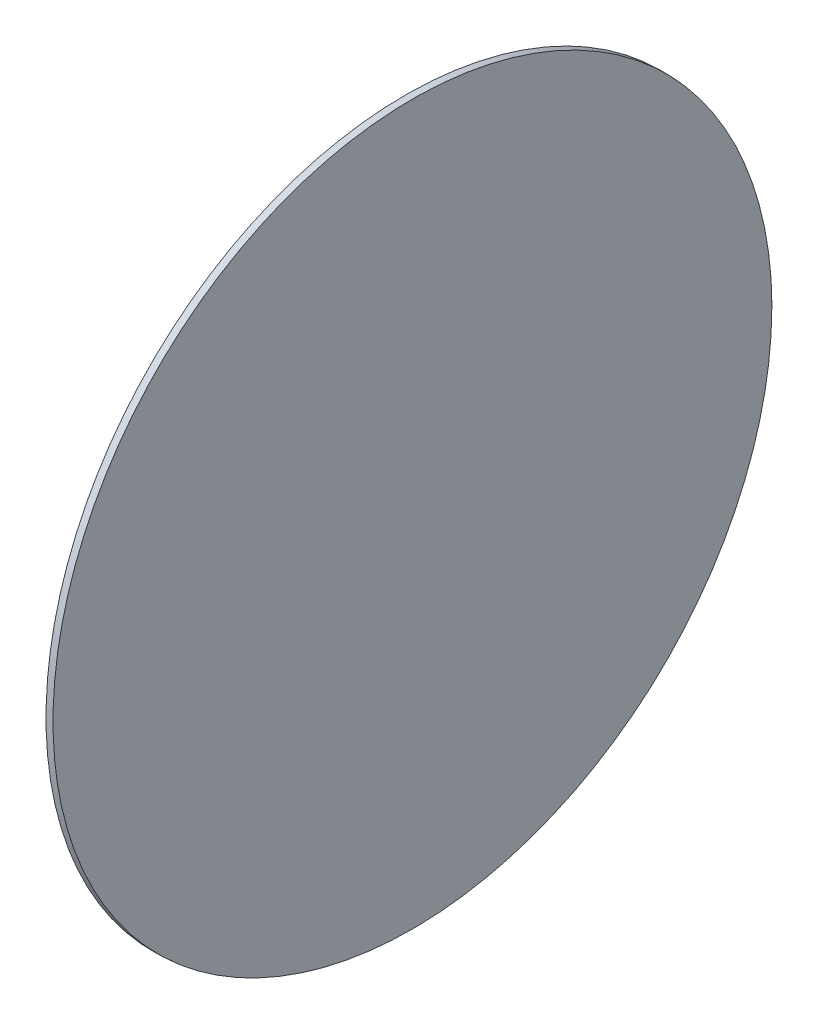
ISO-10303-21;
HEADER;
FILE_DESCRIPTION(('STEP AP214'),'2;1');
FILE_NAME('part.step','',(''),(''),'','','');
FILE_SCHEMA(('AUTOMOTIVE_DESIGN { 1 0 10303 214 1 1 1 1 }'));
ENDSEC;
DATA;
#1=APPLICATION_CONTEXT('core data for automotive mechanical design processes');
#2=APPLICATION_PROTOCOL_DEFINITION('international standard','automotive_design',2000,#1);
#3=PRODUCT_CONTEXT('',#1,'mechanical');
#4=PRODUCT('Part','Part','',(#3));
#5=PRODUCT_RELATED_PRODUCT_CATEGORY('part','',(#4));
#6=PRODUCT_DEFINITION_FORMATION('','',#4);
#7=PRODUCT_DEFINITION_CONTEXT('part definition',#1,'design');
#8=PRODUCT_DEFINITION('design','',#6,#7);
#9=PRODUCT_DEFINITION_SHAPE('','',#8);
#10=(LENGTH_UNIT() NAMED_UNIT(*) SI_UNIT(.MILLI.,.METRE.));
#11=(NAMED_UNIT(*) PLANE_ANGLE_UNIT() SI_UNIT($,.RADIAN.));
#12=(NAMED_UNIT(*) SI_UNIT($,.STERADIAN.) SOLID_ANGLE_UNIT());
#13=UNCERTAINTY_MEASURE_WITH_UNIT(LENGTH_MEASURE(1.E-05),#10,'distance_accuracy_value','');
#14=(GEOMETRIC_REPRESENTATION_CONTEXT(3) GLOBAL_UNCERTAINTY_ASSIGNED_CONTEXT((#13)) GLOBAL_UNIT_ASSIGNED_CONTEXT((#10,
#11,#12)) REPRESENTATION_CONTEXT('',''));
#15=CARTESIAN_POINT('',(0.,0.,0.));
#16=DIRECTION('',(0.,0.,1.));
#17=DIRECTION('',(1.,0.,0.));
#18=AXIS2_PLACEMENT_3D('',#15,#16,#17);
#19=CARTESIAN_POINT('',(257.024122598835,176.743383940744,-231.47823397477));
#20=CARTESIAN_POINT('',(257.024122598835,168.330757265667,-231.47823397477));
#21=CARTESIAN_POINT('',(257.024122598835,151.505503915513,-230.651662281104));
#22=CARTESIAN_POINT('',(257.024122598835,126.510678471353,-226.944030165496));
#23=CARTESIAN_POINT('',(257.024122598835,101.999621440854,-220.804329998851));
#24=CARTESIAN_POINT('',(257.024122598835,78.2083877023261,-212.291690450074));
#25=CARTESIAN_POINT('',(257.024122598835,55.3660998422819,-201.488092891503));
#26=CARTESIAN_POINT('',(257.024122598835,33.6927415796788,-188.497581873475));
#27=CARTESIAN_POINT('',(257.024122598835,13.3970392024482,-173.445263118427));
#28=CARTESIAN_POINT('',(257.024122598835,-5.32554858075743,-156.476098684406));
#29=CARTESIAN_POINT('',(257.024122598835,-22.2947130147782,-137.7535109012));
#30=CARTESIAN_POINT('',(257.024122598836,-37.347031769826,-117.45780852397));
#31=CARTESIAN_POINT('',(257.024122598835,-50.3375427878549,-95.7844502613667));
#32=CARTESIAN_POINT('',(257.024122598836,-61.1411403464257,-72.9421624013225));
#33=CARTESIAN_POINT('',(257.024122598836,-69.6537798952023,-49.1509286627942));
#34=CARTESIAN_POINT('',(257.024122598836,-75.7934800618477,-24.6398716322952));
#35=CARTESIAN_POINT('',(257.024122598835,-79.5011121774556,0.354953811864101));
#36=CARTESIAN_POINT('',(257.024122598835,-80.740969717955,25.5928338370949));
#37=CARTESIAN_POINT('',(257.024122598835,-79.5011121774557,50.8307138623259));
#38=CARTESIAN_POINT('',(257.024122598835,-75.7934800618476,75.825539306485));
#39=CARTESIAN_POINT('',(257.024122598835,-69.6537798952023,100.336596336984));
#40=CARTESIAN_POINT('',(257.024122598835,-61.1411403464257,124.127830075512));
#41=CARTESIAN_POINT('',(257.024122598835,-50.3375427878549,146.970117935557));
#42=CARTESIAN_POINT('',(257.024122598835,-37.347031769826,168.64347619816));
#43=CARTESIAN_POINT('',(257.024122598835,-22.2947130147783,188.93917857539));
#44=CARTESIAN_POINT('',(257.024122598835,-5.3255485807575,207.661766358596));
#45=CARTESIAN_POINT('',(257.024122598836,13.3970392024483,224.630930792617));
#46=CARTESIAN_POINT('',(257.024122598835,33.6927415796788,239.683249547665));
#47=CARTESIAN_POINT('',(257.024122598835,55.3660998422819,252.673760565693));
#48=CARTESIAN_POINT('',(257.024122598835,78.2083877023262,263.477358124264));
#49=CARTESIAN_POINT('',(257.024122598835,101.999621440854,271.989997673041));
#50=CARTESIAN_POINT('',(257.024122598835,126.510678471353,278.129697839686));
#51=CARTESIAN_POINT('',(257.024122598836,151.505503915513,281.837329955294));
#52=CARTESIAN_POINT('',(257.024122598835,176.743383940744,283.077187495794));
#53=CARTESIAN_POINT('',(257.024122598835,201.981263965974,281.837329955294));
#54=CARTESIAN_POINT('',(257.024122598836,226.976089410134,278.129697839686));
#55=CARTESIAN_POINT('',(257.024122598836,251.487146440633,271.989997673041));
#56=CARTESIAN_POINT('',(257.024122598835,275.278380179161,263.477358124264));
#57=CARTESIAN_POINT('',(257.024122598835,298.120668039205,252.673760565693));
#58=CARTESIAN_POINT('',(257.024122598835,319.794026301808,239.683249547665));
#59=CARTESIAN_POINT('',(257.024122598836,340.089728679039,224.630930792617));
#60=CARTESIAN_POINT('',(257.024122598835,358.812316462244,207.661766358596));
#61=CARTESIAN_POINT('',(257.024122598836,375.781480896266,188.93917857539));
#62=CARTESIAN_POINT('',(257.024122598835,390.833799651313,168.64347619816));
#63=CARTESIAN_POINT('',(257.024122598835,403.824310669342,146.970117935557));
#64=CARTESIAN_POINT('',(257.024122598835,414.627908227913,124.127830075512));
#65=CARTESIAN_POINT('',(257.024122598835,423.140547776689,100.336596336984));
#66=CARTESIAN_POINT('',(257.024122598835,429.280247943335,75.8255393064853));
#67=CARTESIAN_POINT('',(257.024122598835,432.987880058943,50.830713862326));
#68=CARTESIAN_POINT('',(257.024122598836,434.227737599442,25.5928338370949));
#69=CARTESIAN_POINT('',(257.024122598835,432.987880058943,0.354953811864209));
#70=CARTESIAN_POINT('',(257.024122598836,429.280247943335,-24.6398716322952));
#71=CARTESIAN_POINT('',(257.024122598835,423.140547776689,-49.1509286627942));
#72=CARTESIAN_POINT('',(257.024122598835,414.627908227913,-72.9421624013226));
#73=CARTESIAN_POINT('',(257.024122598835,403.824310669342,-95.7844502613666));
#74=CARTESIAN_POINT('',(257.024122598836,390.833799651313,-117.45780852397));
#75=CARTESIAN_POINT('',(257.024122598835,375.781480896265,-137.7535109012));
#76=CARTESIAN_POINT('',(257.024122598836,358.812316462245,-156.476098684406));
#77=CARTESIAN_POINT('',(257.024122598835,340.089728679039,-173.445263118427));
#78=CARTESIAN_POINT('',(257.024122598835,319.794026301809,-188.497581873475));
#79=CARTESIAN_POINT('',(257.024122598835,298.120668039205,-201.488092891503));
#80=CARTESIAN_POINT('',(257.024122598835,275.278380179161,-212.291690450074));
#81=CARTESIAN_POINT('',(257.024122598835,251.487146440633,-220.804329998851));
#82=CARTESIAN_POINT('',(257.024122598835,226.976089410134,-226.944030165496));
#83=CARTESIAN_POINT('',(257.024122598835,201.981263965974,-230.651662281104));
#84=CARTESIAN_POINT('',(257.024122598835,185.156010615821,-231.47823397477));
#85=CARTESIAN_POINT('',(257.024122598835,176.743383940744,-231.47823397477));
#86=B_SPLINE_CURVE_WITH_KNOTS('',3,(#19,#20,#21,#22,#23,#24,#25,#26,#27,#28,#29,#30,#31,#32,#33,
#34,#35,#36,#37,#38,#39,#40,#41,#42,#43,#44,#45,#46,#47,#48,#49,#50,#51,#52,#53,#54,#55,#56,#57,
#58,#59,#60,#61,#62,#63,#64,#65,#66,#67,#68,#69,#70,#71,#72,#73,#74,#75,#76,#77,#78,#79,#80,#81,
#82,#83,#84,#85),.UNSPECIFIED.,.T.,.F.,(4,1,1,1,1,1,1,1,1,1,1,1,1,1,1,1,1,1,1,1,1,1,1,1,1,1,1,1,
1,1,1,1,1,1,1,1,1,1,1,1,1,1,1,1,1,1,1,1,1,1,1,1,1,1,1,1,1,1,1,1,1,1,1,1,4),(0.,0.015625,0.03125,
0.046875,0.0625,0.0781249999999999,0.0937499999999999,0.109375,0.125,0.140625,0.15625,0.171875,
0.1875,0.203125,0.21875,0.234375,0.25,0.265625,0.28125,0.296875,0.3125,0.328125,0.34375,
0.359375,0.375,0.390625,0.40625,0.421875,0.4375,0.453125,0.46875,0.484375,0.5,0.515625,0.53125,
0.546875,0.5625,0.578125,0.59375,0.609375,0.625,0.640625,0.65625,0.671875,0.6875,0.703125,
0.71875,0.734375,0.75,0.765625,0.78125,0.796875,0.8125,0.828125,0.84375,0.859375,0.875,0.890625,
0.90625,0.921875,0.9375,0.953125,0.96875,0.984375,1.),.UNSPECIFIED.);
#87=DIRECTION('',(1.,0.,0.));
#88=VECTOR('',#87,1.);
#89=SURFACE_OF_LINEAR_EXTRUSION('',#86,#88);
#90=CARTESIAN_POINT('',(257.024122598835,176.743383940744,-231.47823397477));
#91=CARTESIAN_POINT('',(257.024122598835,180.949697278282,-231.47823397477));
#92=CARTESIAN_POINT('',(257.024122598835,185.156010615821,-231.374912513062));
#93=CARTESIAN_POINT('',(257.024122598835,193.558510016686,-230.962124187308));
#94=CARTESIAN_POINT('',(257.024122598835,197.754696080013,-230.652657323262));
#95=CARTESIAN_POINT('',(257.024122598835,206.126813658245,-229.828075713911));
#96=CARTESIAN_POINT('',(257.024122598835,210.30274517315,-229.312960968605));
#97=CARTESIAN_POINT('',(257.024122598835,218.624323911511,-228.078571368572));
#98=CARTESIAN_POINT('',(257.024122598835,222.769971134969,-227.359296513844));
#99=CARTESIAN_POINT('',(257.024122598835,231.020951547412,-225.718074466802));
#100=CARTESIAN_POINT('',(257.024122598835,235.126284736398,-224.796127274488));
#101=CARTESIAN_POINT('',(257.024122598835,243.286801459968,-222.752024246811));
#102=CARTESIAN_POINT('',(257.024122598835,247.341984994552,-221.629868411448));
#103=CARTESIAN_POINT('',(257.024122598835,255.39236678939,-219.187811792211));
#104=CARTESIAN_POINT('',(257.024122598835,259.387565049643,-217.867911008337));
#105=CARTESIAN_POINT('',(257.024122598835,267.308429521381,-215.033780382592));
#106=CARTESIAN_POINT('',(257.024122598835,271.234095732866,-213.519550540721));
#107=CARTESIAN_POINT('',(257.024122598835,279.006349332628,-210.300177689496));
#108=CARTESIAN_POINT('',(257.024122598835,282.852936720906,-208.595034680143));
#109=CARTESIAN_POINT('',(257.024122598835,290.457866685964,-204.99817068355));
#110=CARTESIAN_POINT('',(257.024122598835,294.216209262744,-203.10644969631));
#111=CARTESIAN_POINT('',(257.024122598835,301.635483616519,-199.140764933544));
#112=CARTESIAN_POINT('',(257.024122598835,305.296415393513,-197.066801158016));
#113=CARTESIAN_POINT('',(257.024122598835,312.51217121905,-192.741843557108));
#114=CARTESIAN_POINT('',(257.024122598835,316.066995267594,-190.490849731728));
#115=CARTESIAN_POINT('',(257.024122598835,323.061838707566,-185.817044769548));
#116=CARTESIAN_POINT('',(257.024122598835,326.501858098995,-183.39423363275));
#117=CARTESIAN_POINT('',(257.024122598835,333.258948111878,-178.382834133486));
#118=CARTESIAN_POINT('',(257.024122598835,336.576018733332,-175.79424577102));
#119=CARTESIAN_POINT('',(257.024122598835,343.079067093404,-170.457331906176));
#120=CARTESIAN_POINT('',(257.024122598835,346.265044832023,-167.709006403796));
#121=CARTESIAN_POINT('',(257.024122598835,352.498394561627,-162.059427522864));
#122=CARTESIAN_POINT('',(257.024122598835,355.545766552611,-159.158174144311));
#123=CARTESIAN_POINT('',(257.024122598835,361.494391922149,-153.209548774773));
#124=CARTESIAN_POINT('',(257.024122598835,364.395645300702,-150.162176783788));
#125=CARTESIAN_POINT('',(257.024122598835,370.045224181634,-143.928827054185));
#126=CARTESIAN_POINT('',(257.024122598835,372.793549684014,-140.742849315566));
#127=CARTESIAN_POINT('',(257.024122598835,378.130463548859,-134.239800955493));
#128=CARTESIAN_POINT('',(257.024122598835,380.719051911324,-130.922730334039));
#129=CARTESIAN_POINT('',(257.024122598835,385.730451410588,-124.165640321156));
#130=CARTESIAN_POINT('',(257.024122598835,388.153262547387,-120.725620929727));
#131=CARTESIAN_POINT('',(257.024122598835,392.827067509566,-113.730777489755));
#132=CARTESIAN_POINT('',(257.024122598835,395.078061334947,-110.175953441212));
#133=CARTESIAN_POINT('',(257.024122598835,399.403018935855,-102.960197615674));
#134=CARTESIAN_POINT('',(257.024122598835,401.476982711382,-99.2992658386805));
#135=CARTESIAN_POINT('',(257.024122598835,405.442667474149,-91.879991484906));
#136=CARTESIAN_POINT('',(257.024122598835,407.334388461388,-88.1216489081254));
#137=CARTESIAN_POINT('',(257.024122598835,410.931252457981,-80.5167189430672));
#138=CARTESIAN_POINT('',(257.024122598835,412.636395467335,-76.6701315547897));
#139=CARTESIAN_POINT('',(257.024122598835,415.855768318559,-68.8978779550276));
#140=CARTESIAN_POINT('',(257.024122598835,417.36999816043,-64.972211743543));
#141=CARTESIAN_POINT('',(257.024122598835,420.204128786175,-57.051347271805));
#142=CARTESIAN_POINT('',(257.024122598835,421.524029570049,-53.0561490115515));
#143=CARTESIAN_POINT('',(257.024122598835,423.966086189286,-45.0057672167136));
#144=CARTESIAN_POINT('',(257.024122598835,425.088242024649,-40.9505836821292));
#145=CARTESIAN_POINT('',(257.024122598835,427.132345052326,-32.7900669585592));
#146=CARTESIAN_POINT('',(257.024122598835,428.054292244641,-28.6847337695735));
#147=CARTESIAN_POINT('',(257.024122598835,429.695514291683,-20.4337533571305));
#148=CARTESIAN_POINT('',(257.024122598835,430.414789146411,-16.2881061336731));
#149=CARTESIAN_POINT('',(257.024122598835,431.649178746444,-7.9665273953112));
#150=CARTESIAN_POINT('',(257.024122598835,432.164293491749,-3.79059588040668));
#151=CARTESIAN_POINT('',(257.024122598835,432.9888751011,4.58152169782498));
#152=CARTESIAN_POINT('',(257.024122598835,433.298341965146,8.77770776115213));
#153=CARTESIAN_POINT('',(257.024122598835,433.711130290901,17.1802071620177));
#154=CARTESIAN_POINT('',(257.024122598835,433.814451752609,21.3865204995562));
#155=CARTESIAN_POINT('',(257.024122598835,433.814451752609,29.7991471746332));
#156=CARTESIAN_POINT('',(257.024122598835,433.711130290901,34.0054605121717));
#157=CARTESIAN_POINT('',(257.024122598835,433.298341965146,42.4079599130373));
#158=CARTESIAN_POINT('',(257.024122598835,432.9888751011,46.6041459763645));
#159=CARTESIAN_POINT('',(257.024122598835,432.164293491749,54.9762635545962));
#160=CARTESIAN_POINT('',(257.024122598835,431.649178746444,59.1521950695008));
#161=CARTESIAN_POINT('',(257.024122598835,430.414789146411,67.4737738078627));
#162=CARTESIAN_POINT('',(257.024122598835,429.695514291683,71.61942103132));
#163=CARTESIAN_POINT('',(257.024122598835,428.054292244641,79.870401443763));
#164=CARTESIAN_POINT('',(257.024122598835,427.132345052326,83.9757346327487));
#165=CARTESIAN_POINT('',(257.024122598835,425.088242024649,92.1362513563188));
#166=CARTESIAN_POINT('',(257.024122598835,423.966086189286,96.1914348909031));
#167=CARTESIAN_POINT('',(257.024122598835,421.524029570049,104.241816685741));
#168=CARTESIAN_POINT('',(257.024122598835,420.204128786175,108.237014945994));
#169=CARTESIAN_POINT('',(257.024122598835,417.36999816043,116.157879417732));
#170=CARTESIAN_POINT('',(257.024122598835,415.85576831856,120.083545629217));
#171=CARTESIAN_POINT('',(257.024122598835,412.636395467335,127.855799228979));
#172=CARTESIAN_POINT('',(257.024122598835,410.931252457981,131.702386617257));
#173=CARTESIAN_POINT('',(257.024122598835,407.334388461388,139.307316582315));
#174=CARTESIAN_POINT('',(257.024122598835,405.442667474149,143.065659159096));
#175=CARTESIAN_POINT('',(257.024122598835,401.476982711383,150.48493351287));
#176=CARTESIAN_POINT('',(257.024122598835,399.403018935855,154.145865289864));
#177=CARTESIAN_POINT('',(257.024122598835,395.078061334947,161.361621115401));
#178=CARTESIAN_POINT('',(257.024122598835,392.827067509567,164.916445163945));
#179=CARTESIAN_POINT('',(257.024122598835,388.153262547387,171.911288603917));
#180=CARTESIAN_POINT('',(257.024122598835,385.730451410588,175.351307995346));
#181=CARTESIAN_POINT('',(257.024122598835,380.719051911324,182.108398008229));
#182=CARTESIAN_POINT('',(257.024122598835,378.130463548859,185.425468629683));
#183=CARTESIAN_POINT('',(257.024122598835,372.793549684014,191.928516989756));
#184=CARTESIAN_POINT('',(257.024122598835,370.045224181635,195.114494728374));
#185=CARTESIAN_POINT('',(257.024122598835,364.395645300702,201.347844457978));
#186=CARTESIAN_POINT('',(257.024122598835,361.494391922149,204.395216448963));
#187=CARTESIAN_POINT('',(257.024122598835,355.545766552612,210.3438418185));
#188=CARTESIAN_POINT('',(257.024122598835,352.498394561627,213.245095197053));
#189=CARTESIAN_POINT('',(257.024122598835,346.265044832023,218.894674077986));
#190=CARTESIAN_POINT('',(257.024122598835,343.079067093405,221.642999580365));
#191=CARTESIAN_POINT('',(257.024122598835,336.576018733332,226.97991344521));
#192=CARTESIAN_POINT('',(257.024122598835,333.258948111878,229.568501807675));
#193=CARTESIAN_POINT('',(257.024122598835,326.501858098995,234.579901306939));
#194=CARTESIAN_POINT('',(257.024122598835,323.061838707566,237.002712443738));
#195=CARTESIAN_POINT('',(257.024122598835,316.066995267594,241.676517405918));
#196=CARTESIAN_POINT('',(257.024122598835,312.512171219051,243.927511231298));
#197=CARTESIAN_POINT('',(257.024122598835,305.296415393513,248.252468832206));
#198=CARTESIAN_POINT('',(257.024122598835,301.635483616519,250.326432607734));
#199=CARTESIAN_POINT('',(257.024122598835,294.216209262745,254.2921173705));
#200=CARTESIAN_POINT('',(257.024122598835,290.457866685964,256.183838357739));
#201=CARTESIAN_POINT('',(257.024122598835,282.852936720906,259.780702354332));
#202=CARTESIAN_POINT('',(257.024122598835,279.006349332628,261.485845363686));
#203=CARTESIAN_POINT('',(257.024122598835,271.234095732866,264.705218214911));
#204=CARTESIAN_POINT('',(257.024122598835,267.308429521382,266.219448056782));
#205=CARTESIAN_POINT('',(257.024122598835,259.387565049644,269.053578682526));
#206=CARTESIAN_POINT('',(257.024122598835,255.39236678939,270.3734794664));
#207=CARTESIAN_POINT('',(257.024122598835,247.341984994552,272.815536085637));
#208=CARTESIAN_POINT('',(257.024122598836,243.286801459968,273.937691921));
#209=CARTESIAN_POINT('',(257.024122598836,235.126284736398,275.981794948678));
#210=CARTESIAN_POINT('',(257.024122598835,231.020951547412,276.903742140992));
#211=CARTESIAN_POINT('',(257.024122598835,222.769971134969,278.544964188034));
#212=CARTESIAN_POINT('',(257.024122598835,218.624323911512,279.264239042762));
#213=CARTESIAN_POINT('',(257.024122598835,210.30274517315,280.498628642795));
#214=CARTESIAN_POINT('',(257.024122598835,206.126813658245,281.0137433881));
#215=CARTESIAN_POINT('',(257.024122598835,197.754696080014,281.838324997452));
#216=CARTESIAN_POINT('',(257.024122598835,193.558510016687,282.147791861498));
#217=CARTESIAN_POINT('',(257.024122598835,185.156010615821,282.560580187252));
#218=CARTESIAN_POINT('',(257.024122598835,180.949697278282,282.663901648961));
#219=CARTESIAN_POINT('',(257.024122598835,172.537070603206,282.663901648961));
#220=CARTESIAN_POINT('',(257.024122598835,168.330757265667,282.560580187252));
#221=CARTESIAN_POINT('',(257.024122598835,159.928257864801,282.147791861498));
#222=CARTESIAN_POINT('',(257.024122598835,155.732071801474,281.838324997452));
#223=CARTESIAN_POINT('',(257.024122598835,147.359954223243,281.013743388101));
#224=CARTESIAN_POINT('',(257.024122598835,143.184022708338,280.498628642795));
#225=CARTESIAN_POINT('',(257.024122598835,134.862443969976,279.264239042762));
#226=CARTESIAN_POINT('',(257.024122598835,130.716796746519,278.544964188035));
#227=CARTESIAN_POINT('',(257.024122598835,122.465816334076,276.903742140992));
#228=CARTESIAN_POINT('',(257.024122598835,118.36048314509,275.981794948678));
#229=CARTESIAN_POINT('',(257.024122598835,110.19996642152,273.937691921001));
#230=CARTESIAN_POINT('',(257.024122598835,106.144782886936,272.815536085638));
#231=CARTESIAN_POINT('',(257.024122598835,98.0944010920977,270.373479466401));
#232=CARTESIAN_POINT('',(257.024122598835,94.0992028318442,269.053578682527));
#233=CARTESIAN_POINT('',(257.024122598835,86.1783383601062,266.219448056782));
#234=CARTESIAN_POINT('',(257.024122598835,82.2526721486217,264.705218214911));
#235=CARTESIAN_POINT('',(257.024122598835,74.4804185488596,261.485845363687));
#236=CARTESIAN_POINT('',(257.024122598835,70.633831160582,259.780702354333));
#237=CARTESIAN_POINT('',(257.024122598835,63.0289011955238,256.18383835774));
#238=CARTESIAN_POINT('',(257.024122598835,59.2705586187432,254.292117370501));
#239=CARTESIAN_POINT('',(257.024122598835,51.8512842649686,250.326432607734));
#240=CARTESIAN_POINT('',(257.024122598835,48.1903524879747,248.252468832207));
#241=CARTESIAN_POINT('',(257.024122598835,40.9745966624374,243.927511231299));
#242=CARTESIAN_POINT('',(257.024122598835,37.4197726138941,241.676517405918));
#243=CARTESIAN_POINT('',(257.024122598835,30.4249291739218,237.002712443739));
#244=CARTESIAN_POINT('',(257.024122598835,26.9849097824929,234.57990130694));
#245=CARTESIAN_POINT('',(257.024122598835,20.2278197696099,229.568501807676));
#246=CARTESIAN_POINT('',(257.024122598835,16.9107491481558,226.979913445211));
#247=CARTESIAN_POINT('',(257.024122598835,10.4077007880831,221.642999580366));
#248=CARTESIAN_POINT('',(257.024122598835,7.22172304946442,218.894674077986));
#249=CARTESIAN_POINT('',(257.024122598835,0.988373319860833,213.245095197054));
#250=CARTESIAN_POINT('',(257.024122598835,-2.05899867112409,210.343841818501));
#251=CARTESIAN_POINT('',(257.024122598835,-8.00762404066186,204.395216448963));
#252=CARTESIAN_POINT('',(257.024122598835,-10.9088774192147,201.347844457978));
#253=CARTESIAN_POINT('',(257.024122598835,-16.5584563001472,195.114494728375));
#254=CARTESIAN_POINT('',(257.024122598835,-19.3067818025268,191.928516989756));
#255=CARTESIAN_POINT('',(257.024122598835,-24.6436956673715,185.425468629684));
#256=CARTESIAN_POINT('',(257.024122598835,-27.2322840298367,182.108398008229));
#257=CARTESIAN_POINT('',(257.024122598835,-32.2436835291007,175.351307995347));
#258=CARTESIAN_POINT('',(257.024122598835,-34.6664946658995,171.911288603918));
#259=CARTESIAN_POINT('',(257.024122598835,-39.340299628079,164.916445163945));
#260=CARTESIAN_POINT('',(257.024122598835,-41.5912934534596,161.361621115402));
#261=CARTESIAN_POINT('',(257.024122598835,-45.9162510543676,154.145865289865));
#262=CARTESIAN_POINT('',(257.024122598835,-47.990214829895,150.484933512871));
#263=CARTESIAN_POINT('',(257.024122598835,-51.9558995926616,143.065659159096));
#264=CARTESIAN_POINT('',(257.024122598835,-53.8476205799008,139.307316582316));
#265=CARTESIAN_POINT('',(257.024122598835,-57.4444845764938,131.702386617257));
#266=CARTESIAN_POINT('',(257.024122598835,-59.1496275858475,127.85579922898));
#267=CARTESIAN_POINT('',(257.024122598835,-62.3690004370721,120.083545629218));
#268=CARTESIAN_POINT('',(257.024122598835,-63.883230278943,116.157879417733));
#269=CARTESIAN_POINT('',(257.024122598835,-66.7173609046878,108.237014945995));
#270=CARTESIAN_POINT('',(257.024122598835,-68.0372616885618,104.241816685742));
#271=CARTESIAN_POINT('',(257.024122598835,-70.4793183077988,96.1914348909038));
#272=CARTESIAN_POINT('',(257.024122598835,-71.6014741431618,92.1362513563194));
#273=CARTESIAN_POINT('',(257.024122598835,-73.6455771708392,83.9757346327493));
#274=CARTESIAN_POINT('',(257.024122598835,-74.5675243631535,79.8704014437636));
#275=CARTESIAN_POINT('',(257.024122598835,-76.2087464101958,71.6194210313205));
#276=CARTESIAN_POINT('',(257.024122598835,-76.9280212649237,67.4737738078632));
#277=CARTESIAN_POINT('',(257.024122598835,-78.1624108649568,59.1521950695013));
#278=CARTESIAN_POINT('',(257.024122598835,-78.6775256102619,54.9762635545968));
#279=CARTESIAN_POINT('',(257.024122598835,-79.5021072196132,46.6041459763651));
#280=CARTESIAN_POINT('',(257.024122598835,-79.8115740836592,42.4079599130379));
#281=CARTESIAN_POINT('',(257.024122598835,-80.2243624094136,34.0054605121722));
#282=CARTESIAN_POINT('',(257.024122598835,-80.3276838711219,29.7991471746337));
#283=CARTESIAN_POINT('',(257.024122598835,-80.3276838711218,21.3865204995568));
#284=CARTESIAN_POINT('',(257.024122598835,-80.2243624094136,17.1802071620183));
#285=CARTESIAN_POINT('',(257.024122598835,-79.8115740836592,8.77770776115265));
#286=CARTESIAN_POINT('',(257.024122598835,-79.5021072196131,4.5815216978255));
#287=CARTESIAN_POINT('',(257.024122598835,-78.6775256102619,-3.79059588040619));
#288=CARTESIAN_POINT('',(257.024122598835,-78.1624108649568,-7.96652739531072));
#289=CARTESIAN_POINT('',(257.024122598835,-76.9280212649238,-16.2881061336726));
#290=CARTESIAN_POINT('',(257.024122598835,-76.2087464101959,-20.43375335713));
#291=CARTESIAN_POINT('',(257.024122598835,-74.5675243631537,-28.684733769573));
#292=CARTESIAN_POINT('',(257.024122598836,-73.6455771708394,-32.7900669585587));
#293=CARTESIAN_POINT('',(257.024122598836,-71.601474143162,-40.9505836821288));
#294=CARTESIAN_POINT('',(257.024122598836,-70.479318307799,-45.0057672167132));
#295=CARTESIAN_POINT('',(257.024122598836,-68.037261688562,-53.0561490115511));
#296=CARTESIAN_POINT('',(257.024122598836,-66.717360904688,-57.0513472718046));
#297=CARTESIAN_POINT('',(257.024122598836,-63.8832302789432,-64.9722117435426));
#298=CARTESIAN_POINT('',(257.024122598836,-62.3690004370723,-68.8978779550272));
#299=CARTESIAN_POINT('',(257.024122598836,-59.1496275858478,-76.6701315547893));
#300=CARTESIAN_POINT('',(257.024122598835,-57.4444845764941,-80.5167189430668));
#301=CARTESIAN_POINT('',(257.024122598835,-53.8476205799012,-88.1216489081251));
#302=CARTESIAN_POINT('',(257.024122598835,-51.9558995926619,-91.8799914849057));
#303=CARTESIAN_POINT('',(257.024122598835,-47.9902148298953,-99.2992658386803));
#304=CARTESIAN_POINT('',(257.024122598835,-45.9162510543679,-102.960197615674));
#305=CARTESIAN_POINT('',(257.024122598836,-41.59129345346,-110.175953441211));
#306=CARTESIAN_POINT('',(257.024122598836,-39.3402996280794,-113.730777489755));
#307=CARTESIAN_POINT('',(257.024122598836,-34.6664946658999,-120.725620929727));
#308=CARTESIAN_POINT('',(257.024122598835,-32.2436835291011,-124.165640321156));
#309=CARTESIAN_POINT('',(257.024122598835,-27.2322840298371,-130.922730334039));
#310=CARTESIAN_POINT('',(257.024122598835,-24.6436956673719,-134.239800955493));
#311=CARTESIAN_POINT('',(257.024122598835,-19.3067818025271,-140.742849315566));
#312=CARTESIAN_POINT('',(257.024122598835,-16.5584563001475,-143.928827054184));
#313=CARTESIAN_POINT('',(257.024122598835,-10.9088774192151,-150.162176783788));
#314=CARTESIAN_POINT('',(257.024122598835,-8.00762404066225,-153.209548774773));
#315=CARTESIAN_POINT('',(257.024122598835,-2.05899867112451,-159.158174144311));
#316=CARTESIAN_POINT('',(257.024122598835,0.988373319860394,-162.059427522864));
#317=CARTESIAN_POINT('',(257.024122598835,7.22172304946394,-167.709006403796));
#318=CARTESIAN_POINT('',(257.024122598835,10.4077007880826,-170.457331906176));
#319=CARTESIAN_POINT('',(257.024122598835,16.9107491481553,-175.79424577102));
#320=CARTESIAN_POINT('',(257.024122598835,20.2278197696093,-178.382834133485));
#321=CARTESIAN_POINT('',(257.024122598835,26.9849097824924,-183.394233632749));
#322=CARTESIAN_POINT('',(257.024122598835,30.4249291739213,-185.817044769548));
#323=CARTESIAN_POINT('',(257.024122598835,37.4197726138936,-190.490849731728));
#324=CARTESIAN_POINT('',(257.024122598835,40.9745966624369,-192.741843557108));
#325=CARTESIAN_POINT('',(257.024122598835,48.1903524879742,-197.066801158016));
#326=CARTESIAN_POINT('',(257.024122598835,51.8512842649681,-199.140764933544));
#327=CARTESIAN_POINT('',(257.024122598835,59.2705586187427,-203.10644969631));
#328=CARTESIAN_POINT('',(257.024122598835,63.0289011955233,-204.99817068355));
#329=CARTESIAN_POINT('',(257.024122598835,70.6338311605815,-208.595034680143));
#330=CARTESIAN_POINT('',(257.024122598835,74.480418548859,-210.300177689496));
#331=CARTESIAN_POINT('',(257.024122598835,82.2526721486211,-213.519550540721));
#332=CARTESIAN_POINT('',(257.024122598835,86.1783383601057,-215.033780382592));
#333=CARTESIAN_POINT('',(257.024122598835,94.0992028318437,-217.867911008336));
#334=CARTESIAN_POINT('',(257.024122598835,98.0944010920972,-219.18781179221));
#335=CARTESIAN_POINT('',(257.024122598835,106.144782886935,-221.629868411447));
#336=CARTESIAN_POINT('',(257.024122598835,110.199966421519,-222.75202424681));
#337=CARTESIAN_POINT('',(257.024122598835,118.36048314509,-224.796127274488));
#338=CARTESIAN_POINT('',(257.024122598835,122.465816334075,-225.718074466802));
#339=CARTESIAN_POINT('',(257.024122598835,130.716796746518,-227.359296513844));
#340=CARTESIAN_POINT('',(257.024122598835,134.862443969976,-228.078571368572));
#341=CARTESIAN_POINT('',(257.024122598835,143.184022708338,-229.312960968605));
#342=CARTESIAN_POINT('',(257.024122598835,147.359954223242,-229.828075713911));
#343=CARTESIAN_POINT('',(257.024122598835,155.732071801474,-230.652657323262));
#344=CARTESIAN_POINT('',(257.024122598835,159.928257864801,-230.962124187308));
#345=CARTESIAN_POINT('',(257.024122598835,168.330757265667,-231.374912513062));
#346=CARTESIAN_POINT('',(257.024122598835,172.537070603205,-231.47823397477));
#347=CARTESIAN_POINT('',(257.024122598835,176.743383940744,-231.47823397477));
#348=B_SPLINE_CURVE_WITH_KNOTS('',3,(#90,#91,#92,#93,#94,#95,#96,#97,#98,#99,#100,#101,#102,
#103,#104,#105,#106,#107,#108,#109,#110,#111,#112,#113,#114,#115,#116,#117,#118,#119,#120,#121,
#122,#123,#124,#125,#126,#127,#128,#129,#130,#131,#132,#133,#134,#135,#136,#137,#138,#139,#140,
#141,#142,#143,#144,#145,#146,#147,#148,#149,#150,#151,#152,#153,#154,#155,#156,#157,#158,#159,
#160,#161,#162,#163,#164,#165,#166,#167,#168,#169,#170,#171,#172,#173,#174,#175,#176,#177,#178,
#179,#180,#181,#182,#183,#184,#185,#186,#187,#188,#189,#190,#191,#192,#193,#194,#195,#196,#197,
#198,#199,#200,#201,#202,#203,#204,#205,#206,#207,#208,#209,#210,#211,#212,#213,#214,#215,#216,
#217,#218,#219,#220,#221,#222,#223,#224,#225,#226,#227,#228,#229,#230,#231,#232,#233,#234,#235,
#236,#237,#238,#239,#240,#241,#242,#243,#244,#245,#246,#247,#248,#249,#250,#251,#252,#253,#254,
#255,#256,#257,#258,#259,#260,#261,#262,#263,#264,#265,#266,#267,#268,#269,#270,#271,#272,#273,
#274,#275,#276,#277,#278,#279,#280,#281,#282,#283,#284,#285,#286,#287,#288,#289,#290,#291,#292,
#293,#294,#295,#296,#297,#298,#299,#300,#301,#302,#303,#304,#305,#306,#307,#308,#309,#310,#311,
#312,#313,#314,#315,#316,#317,#318,#319,#320,#321,#322,#323,#324,#325,#326,#327,#328,#329,#330,
#331,#332,#333,#334,#335,#336,#337,#338,#339,#340,#341,#342,#343,#344,#345,#346,#347),
.UNSPECIFIED.,.F.,.F.,(4,2,2,2,2,2,2,2,2,2,2,2,2,2,2,2,2,2,2,2,2,2,2,2,2,2,2,2,2,2,2,2,2,2,2,2,
2,2,2,2,2,2,2,2,2,2,2,2,2,2,2,2,2,2,2,2,2,2,2,2,2,2,2,2,2,2,2,2,2,2,2,2,2,2,2,2,2,2,2,2,2,2,2,2,
2,2,2,2,2,2,2,2,2,2,2,2,2,2,2,2,2,2,2,2,2,2,2,2,2,2,2,2,2,2,2,2,2,2,2,2,2,2,2,2,2,2,2,2,4),(0.,
12.617678113851,25.2353562277021,37.8530343415532,50.4707124554042,63.0883905692552,
75.7060686831063,88.3237467969574,100.941424910808,113.559103024659,126.17678113851,
138.794459252362,151.412137366213,164.029815480064,176.647493593915,189.265171707766,
201.882849821617,214.500527935468,227.118206049319,239.73588416317,252.353562277021,
264.971240390872,277.588918504723,290.206596618574,302.824274732425,315.441952846276,
328.059630960127,340.677309073979,353.29498718783,365.912665301681,378.530343415532,
391.148021529383,403.765699643234,416.383377757085,429.001055870936,441.618733984787,
454.236412098638,466.854090212489,479.47176832634,492.089446440191,504.707124554042,
517.324802667893,529.942480781744,542.560158895595,555.177837009446,567.795515123297,
580.413193237148,593.030871351,605.648549464851,618.266227578702,630.883905692553,
643.501583806404,656.119261920255,668.736940034106,681.354618147957,693.972296261808,
706.589974375659,719.20765248951,731.825330603361,744.443008717212,757.060686831063,
769.678364944914,782.296043058765,794.913721172616,807.531399286467,820.149077400319,
832.76675551417,845.384433628021,858.002111741872,870.619789855723,883.237467969574,
895.855146083425,908.472824197276,921.090502311127,933.708180424978,946.325858538829,
958.94353665268,971.561214766531,984.178892880382,996.796570994233,1009.41424910808,
1022.03192722194,1034.64960533579,1047.26728344964,1059.88496156349,1072.50263967734,
1085.12031779119,1097.73799590504,1110.35567401889,1122.97335213274,1135.59103024659,
1148.20870836045,1160.8263864743,1173.44406458815,1186.061742702,1198.67942081585,
1211.2970989297,1223.91477704355,1236.5324551574,1249.15013327125,1261.76781138511,
1274.38548949896,1287.00316761281,1299.62084572666,1312.23852384051,1324.85620195436,
1337.47388006821,1350.09155818206,1362.70923629591,1375.32691440977,1387.94459252362,
1400.56227063747,1413.17994875132,1425.79762686517,1438.41530497902,1451.03298309287,
1463.65066120672,1476.26833932057,1488.88601743443,1501.50369554828,1514.12137366213,
1526.73905177598,1539.35672988983,1551.97440800368,1564.59208611753,1577.20976423138,
1589.82744234523,1602.44512045909,1615.06279857294),.UNSPECIFIED.);
#349=CARTESIAN_POINT('',(257.024122598835,176.743383940744,-231.47823397477));
#350=VERTEX_POINT('',#349);
#351=EDGE_CURVE('E9',#350,#350,#348,.F.);
#352=ORIENTED_EDGE('',*,*,#351,.F.);
#353=EDGE_LOOP('',(#352));
#354=FACE_BOUND('',#353,.T.);
#355=CARTESIAN_POINT('',(262.024122598835,176.743383940744,-231.47823397477));
#356=CARTESIAN_POINT('',(262.024122598835,168.330757265667,-231.47823397477));
#357=CARTESIAN_POINT('',(262.024122598835,151.505503915513,-230.651662281104));
#358=CARTESIAN_POINT('',(262.024122598835,126.510678471353,-226.944030165496));
#359=CARTESIAN_POINT('',(262.024122598835,101.999621440854,-220.804329998851));
#360=CARTESIAN_POINT('',(262.024122598835,78.2083877023261,-212.291690450074));
#361=CARTESIAN_POINT('',(262.024122598835,55.3660998422819,-201.488092891503));
#362=CARTESIAN_POINT('',(262.024122598835,33.6927415796788,-188.497581873475));
#363=CARTESIAN_POINT('',(262.024122598835,13.3970392024482,-173.445263118427));
#364=CARTESIAN_POINT('',(262.024122598835,-5.32554858075743,-156.476098684406));
#365=CARTESIAN_POINT('',(262.024122598835,-22.2947130147782,-137.7535109012));
#366=CARTESIAN_POINT('',(262.024122598836,-37.347031769826,-117.45780852397));
#367=CARTESIAN_POINT('',(262.024122598835,-50.3375427878549,-95.7844502613667));
#368=CARTESIAN_POINT('',(262.024122598836,-61.1411403464257,-72.9421624013225));
#369=CARTESIAN_POINT('',(262.024122598836,-69.6537798952023,-49.1509286627942));
#370=CARTESIAN_POINT('',(262.024122598836,-75.7934800618477,-24.6398716322952));
#371=CARTESIAN_POINT('',(262.024122598835,-79.5011121774556,0.354953811864101));
#372=CARTESIAN_POINT('',(262.024122598835,-80.740969717955,25.5928338370949));
#373=CARTESIAN_POINT('',(262.024122598835,-79.5011121774557,50.8307138623259));
#374=CARTESIAN_POINT('',(262.024122598835,-75.7934800618476,75.825539306485));
#375=CARTESIAN_POINT('',(262.024122598835,-69.6537798952023,100.336596336984));
#376=CARTESIAN_POINT('',(262.024122598835,-61.1411403464257,124.127830075512));
#377=CARTESIAN_POINT('',(262.024122598835,-50.3375427878549,146.970117935557));
#378=CARTESIAN_POINT('',(262.024122598835,-37.347031769826,168.64347619816));
#379=CARTESIAN_POINT('',(262.024122598835,-22.2947130147783,188.93917857539));
#380=CARTESIAN_POINT('',(262.024122598835,-5.3255485807575,207.661766358596));
#381=CARTESIAN_POINT('',(262.024122598836,13.3970392024483,224.630930792617));
#382=CARTESIAN_POINT('',(262.024122598835,33.6927415796788,239.683249547665));
#383=CARTESIAN_POINT('',(262.024122598835,55.3660998422819,252.673760565693));
#384=CARTESIAN_POINT('',(262.024122598835,78.2083877023262,263.477358124264));
#385=CARTESIAN_POINT('',(262.024122598835,101.999621440854,271.989997673041));
#386=CARTESIAN_POINT('',(262.024122598835,126.510678471353,278.129697839686));
#387=CARTESIAN_POINT('',(262.024122598836,151.505503915513,281.837329955294));
#388=CARTESIAN_POINT('',(262.024122598835,176.743383940744,283.077187495794));
#389=CARTESIAN_POINT('',(262.024122598835,201.981263965974,281.837329955294));
#390=CARTESIAN_POINT('',(262.024122598836,226.976089410134,278.129697839686));
#391=CARTESIAN_POINT('',(262.024122598836,251.487146440633,271.989997673041));
#392=CARTESIAN_POINT('',(262.024122598835,275.278380179161,263.477358124264));
#393=CARTESIAN_POINT('',(262.024122598835,298.120668039205,252.673760565693));
#394=CARTESIAN_POINT('',(262.024122598835,319.794026301808,239.683249547665));
#395=CARTESIAN_POINT('',(262.024122598836,340.089728679039,224.630930792617));
#396=CARTESIAN_POINT('',(262.024122598835,358.812316462244,207.661766358596));
#397=CARTESIAN_POINT('',(262.024122598836,375.781480896266,188.93917857539));
#398=CARTESIAN_POINT('',(262.024122598835,390.833799651313,168.64347619816));
#399=CARTESIAN_POINT('',(262.024122598835,403.824310669342,146.970117935557));
#400=CARTESIAN_POINT('',(262.024122598835,414.627908227913,124.127830075512));
#401=CARTESIAN_POINT('',(262.024122598835,423.140547776689,100.336596336984));
#402=CARTESIAN_POINT('',(262.024122598835,429.280247943335,75.8255393064853));
#403=CARTESIAN_POINT('',(262.024122598835,432.987880058943,50.830713862326));
#404=CARTESIAN_POINT('',(262.024122598836,434.227737599442,25.5928338370949));
#405=CARTESIAN_POINT('',(262.024122598835,432.987880058943,0.354953811864209));
#406=CARTESIAN_POINT('',(262.024122598836,429.280247943335,-24.6398716322952));
#407=CARTESIAN_POINT('',(262.024122598835,423.140547776689,-49.1509286627942));
#408=CARTESIAN_POINT('',(262.024122598835,414.627908227913,-72.9421624013226));
#409=CARTESIAN_POINT('',(262.024122598835,403.824310669342,-95.7844502613666));
#410=CARTESIAN_POINT('',(262.024122598836,390.833799651313,-117.45780852397));
#411=CARTESIAN_POINT('',(262.024122598835,375.781480896265,-137.7535109012));
#412=CARTESIAN_POINT('',(262.024122598836,358.812316462245,-156.476098684406));
#413=CARTESIAN_POINT('',(262.024122598835,340.089728679039,-173.445263118427));
#414=CARTESIAN_POINT('',(262.024122598835,319.794026301809,-188.497581873475));
#415=CARTESIAN_POINT('',(262.024122598835,298.120668039205,-201.488092891503));
#416=CARTESIAN_POINT('',(262.024122598835,275.278380179161,-212.291690450074));
#417=CARTESIAN_POINT('',(262.024122598835,251.487146440633,-220.804329998851));
#418=CARTESIAN_POINT('',(262.024122598835,226.976089410134,-226.944030165496));
#419=CARTESIAN_POINT('',(262.024122598835,201.981263965974,-230.651662281104));
#420=CARTESIAN_POINT('',(262.024122598835,185.156010615821,-231.47823397477));
#421=CARTESIAN_POINT('',(262.024122598835,176.743383940744,-231.47823397477));
#422=B_SPLINE_CURVE_WITH_KNOTS('',3,(#355,#356,#357,#358,#359,#360,#361,#362,#363,#364,#365,
#366,#367,#368,#369,#370,#371,#372,#373,#374,#375,#376,#377,#378,#379,#380,#381,#382,#383,#384,
#385,#386,#387,#388,#389,#390,#391,#392,#393,#394,#395,#396,#397,#398,#399,#400,#401,#402,#403,
#404,#405,#406,#407,#408,#409,#410,#411,#412,#413,#414,#415,#416,#417,#418,#419,#420,#421),
.UNSPECIFIED.,.T.,.F.,(4,1,1,1,1,1,1,1,1,1,1,1,1,1,1,1,1,1,1,1,1,1,1,1,1,1,1,1,1,1,1,1,1,1,1,1,
1,1,1,1,1,1,1,1,1,1,1,1,1,1,1,1,1,1,1,1,1,1,1,1,1,1,1,1,4),(0.,0.015625,0.03125,0.046875,0.0625,
0.0781249999999999,0.0937499999999999,0.109375,0.125,0.140625,0.15625,0.171875,0.1875,0.203125,
0.21875,0.234375,0.25,0.265625,0.28125,0.296875,0.3125,0.328125,0.34375,0.359375,0.375,0.390625,
0.40625,0.421875,0.4375,0.453125,0.46875,0.484375,0.5,0.515625,0.53125,0.546875,0.5625,0.578125,
0.59375,0.609375,0.625,0.640625,0.65625,0.671875,0.6875,0.703125,0.71875,0.734375,0.75,0.765625,
0.78125,0.796875,0.8125,0.828125,0.84375,0.859375,0.875,0.890625,0.90625,0.921875,0.9375,
0.953125,0.96875,0.984375,1.),.UNSPECIFIED.);
#423=CARTESIAN_POINT('',(262.024122598835,176.743383940744,-231.47823397477));
#424=VERTEX_POINT('',#423);
#425=EDGE_CURVE('E24',#424,#424,#422,.T.);
#426=ORIENTED_EDGE('',*,*,#425,.T.);
#427=EDGE_LOOP('',(#426));
#428=FACE_BOUND('',#427,.T.);
#429=ADVANCED_FACE('F14',(#354,#428),#89,.F.);
#430=CARTESIAN_POINT('',(257.024122598835,176.743383940744,-224.407166162905));
#431=DIRECTION('',(1.,0.,0.));
#432=DIRECTION('',(0.,1.,0.));
#433=AXIS2_PLACEMENT_3D('',#430,#431,#432);
#434=PLANE('',#433);
#435=ORIENTED_EDGE('',*,*,#351,.T.);
#436=EDGE_LOOP('',(#435));
#437=FACE_BOUND('',#436,.T.);
#438=ADVANCED_FACE('F59',(#437),#434,.F.);
#439=CARTESIAN_POINT('',(262.024122598835,176.743383940744,-224.407166162905));
#440=DIRECTION('',(1.,0.,0.));
#441=DIRECTION('',(0.,1.,0.));
#442=AXIS2_PLACEMENT_3D('',#439,#440,#441);
#443=PLANE('',#442);
#444=ORIENTED_EDGE('',*,*,#425,.F.);
#445=EDGE_LOOP('',(#444));
#446=FACE_BOUND('',#445,.T.);
#447=ADVANCED_FACE('F67',(#446),#443,.T.);
#448=CLOSED_SHELL('',(#429,#438,#447));
#449=MANIFOLD_SOLID_BREP('B1',#448);
#450=ADVANCED_BREP_SHAPE_REPRESENTATION('',(#18,#449),#14);
#451=SHAPE_DEFINITION_REPRESENTATION(#9,#450);
ENDSEC;
END-ISO-10303-21;
